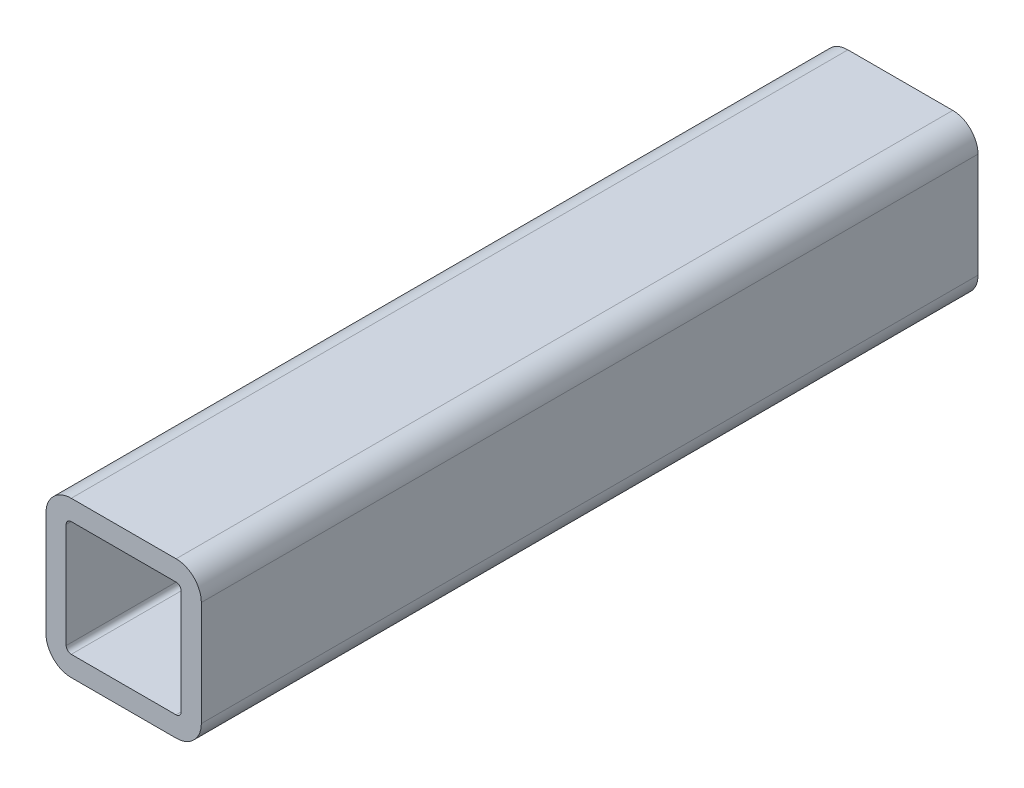
ISO-10303-21;
HEADER;
FILE_DESCRIPTION(('STEP AP214'),'2;1');
FILE_NAME('part.step','',(''),(''),'','','');
FILE_SCHEMA(('AUTOMOTIVE_DESIGN { 1 0 10303 214 1 1 1 1 }'));
ENDSEC;
DATA;
#1=APPLICATION_CONTEXT('core data for automotive mechanical design processes');
#2=APPLICATION_PROTOCOL_DEFINITION('international standard','automotive_design',2000,#1);
#3=PRODUCT_CONTEXT('',#1,'mechanical');
#4=PRODUCT('Part','Part','',(#3));
#5=PRODUCT_RELATED_PRODUCT_CATEGORY('part','',(#4));
#6=PRODUCT_DEFINITION_FORMATION('','',#4);
#7=PRODUCT_DEFINITION_CONTEXT('part definition',#1,'design');
#8=PRODUCT_DEFINITION('design','',#6,#7);
#9=PRODUCT_DEFINITION_SHAPE('','',#8);
#10=(LENGTH_UNIT() NAMED_UNIT(*) SI_UNIT(.MILLI.,.METRE.));
#11=(NAMED_UNIT(*) PLANE_ANGLE_UNIT() SI_UNIT($,.RADIAN.));
#12=(NAMED_UNIT(*) SI_UNIT($,.STERADIAN.) SOLID_ANGLE_UNIT());
#13=UNCERTAINTY_MEASURE_WITH_UNIT(LENGTH_MEASURE(1.E-05),#10,'distance_accuracy_value','');
#14=(GEOMETRIC_REPRESENTATION_CONTEXT(3) GLOBAL_UNCERTAINTY_ASSIGNED_CONTEXT((#13)) GLOBAL_UNIT_ASSIGNED_CONTEXT((#10,
#11,#12)) REPRESENTATION_CONTEXT('',''));
#15=CARTESIAN_POINT('',(0.,0.,0.));
#16=DIRECTION('',(0.,0.,1.));
#17=DIRECTION('',(1.,0.,0.));
#18=AXIS2_PLACEMENT_3D('',#15,#16,#17);
#19=CARTESIAN_POINT('',(4.28625000000001,-4.28625000000001,31.75));
#20=DIRECTION('',(0.,0.,1.));
#21=DIRECTION('',(1.,0.,0.));
#22=AXIS2_PLACEMENT_3D('',#19,#20,#21);
#23=PLANE('',#22);
#24=CARTESIAN_POINT('',(4.28625000000001,-4.28625000000001,31.75));
#25=DIRECTION('',(0.,0.,1.));
#26=DIRECTION('',(1.,0.,0.));
#27=AXIS2_PLACEMENT_3D('',#24,#25,#26);
#28=CIRCLE('',#27,2.06375);
#29=CARTESIAN_POINT('',(4.28625000000001,-6.35000000000001,31.75));
#30=VERTEX_POINT('',#29);
#31=CARTESIAN_POINT('',(6.35000000000001,-4.28625000000001,31.75));
#32=VERTEX_POINT('',#31);
#33=EDGE_CURVE('E248',#30,#32,#28,.T.);
#34=ORIENTED_EDGE('',*,*,#33,.T.);
#35=DIRECTION('',(0.,1.,0.));
#36=VECTOR('',#35,1.);
#37=CARTESIAN_POINT('',(6.35000000000001,-4.28625000000001,31.75));
#38=LINE('',#37,#36);
#39=CARTESIAN_POINT('',(6.35000000000001,4.28625000000001,31.75));
#40=VERTEX_POINT('',#39);
#41=EDGE_CURVE('E252',#32,#40,#38,.T.);
#42=ORIENTED_EDGE('',*,*,#41,.T.);
#43=CARTESIAN_POINT('',(4.28625000000001,4.28625000000001,31.75));
#44=DIRECTION('',(0.,0.,1.));
#45=DIRECTION('',(1.,0.,0.));
#46=AXIS2_PLACEMENT_3D('',#43,#44,#45);
#47=CIRCLE('',#46,2.06375);
#48=CARTESIAN_POINT('',(4.28625000000001,6.35000000000001,31.75));
#49=VERTEX_POINT('',#48);
#50=EDGE_CURVE('E256',#40,#49,#47,.T.);
#51=ORIENTED_EDGE('',*,*,#50,.T.);
#52=DIRECTION('',(-1.,0.,0.));
#53=VECTOR('',#52,1.);
#54=CARTESIAN_POINT('',(4.28625000000001,6.35000000000001,31.75));
#55=LINE('',#54,#53);
#56=CARTESIAN_POINT('',(-4.28625000000001,6.35000000000001,31.75));
#57=VERTEX_POINT('',#56);
#58=EDGE_CURVE('E259',#49,#57,#55,.T.);
#59=ORIENTED_EDGE('',*,*,#58,.T.);
#60=CARTESIAN_POINT('',(-4.28625000000001,4.28625000000001,31.75));
#61=DIRECTION('',(0.,0.,1.));
#62=DIRECTION('',(1.,0.,0.));
#63=AXIS2_PLACEMENT_3D('',#60,#61,#62);
#64=CIRCLE('',#63,2.06375);
#65=CARTESIAN_POINT('',(-6.35000000000001,4.28625000000001,31.75));
#66=VERTEX_POINT('',#65);
#67=EDGE_CURVE('E262',#57,#66,#64,.T.);
#68=ORIENTED_EDGE('',*,*,#67,.T.);
#69=DIRECTION('',(0.,-1.,0.));
#70=VECTOR('',#69,1.);
#71=CARTESIAN_POINT('',(-6.35000000000001,-4.28625000000001,31.75));
#72=LINE('',#71,#70);
#73=CARTESIAN_POINT('',(-6.35000000000001,-4.28625000000001,31.75));
#74=VERTEX_POINT('',#73);
#75=EDGE_CURVE('E265',#66,#74,#72,.T.);
#76=ORIENTED_EDGE('',*,*,#75,.T.);
#77=CARTESIAN_POINT('',(-4.28625000000001,-4.28625000000001,31.75));
#78=DIRECTION('',(0.,0.,1.));
#79=DIRECTION('',(1.,0.,0.));
#80=AXIS2_PLACEMENT_3D('',#77,#78,#79);
#81=CIRCLE('',#80,2.06375);
#82=CARTESIAN_POINT('',(-4.28625000000001,-6.35000000000001,31.75));
#83=VERTEX_POINT('',#82);
#84=EDGE_CURVE('E268',#74,#83,#81,.T.);
#85=ORIENTED_EDGE('',*,*,#84,.T.);
#86=DIRECTION('',(1.,0.,0.));
#87=VECTOR('',#86,1.);
#88=CARTESIAN_POINT('',(4.28625000000001,-6.35000000000001,31.75));
#89=LINE('',#88,#87);
#90=EDGE_CURVE('E271',#83,#30,#89,.T.);
#91=ORIENTED_EDGE('',*,*,#90,.T.);
#92=EDGE_LOOP('',(#34,#42,#51,#59,#68,#76,#85,#91));
#93=FACE_BOUND('',#92,.T.);
#94=DIRECTION('',(-1.,0.,0.));
#95=VECTOR('',#94,1.);
#96=CARTESIAN_POINT('',(4.28625000000001,4.69900000000001,31.75));
#97=LINE('',#96,#95);
#98=CARTESIAN_POINT('',(4.28625000000001,4.69900000000001,31.75));
#99=VERTEX_POINT('',#98);
#100=CARTESIAN_POINT('',(-4.28625000000001,4.69900000000001,31.75));
#101=VERTEX_POINT('',#100);
#102=EDGE_CURVE('E168',#99,#101,#97,.T.);
#103=ORIENTED_EDGE('',*,*,#102,.F.);
#104=CARTESIAN_POINT('',(4.28625000000001,4.28625000000001,31.75));
#105=DIRECTION('',(0.,0.,1.));
#106=DIRECTION('',(1.,0.,0.));
#107=AXIS2_PLACEMENT_3D('',#104,#105,#106);
#108=CIRCLE('',#107,0.412750000000003);
#109=CARTESIAN_POINT('',(4.69900000000001,4.28625000000001,31.75));
#110=VERTEX_POINT('',#109);
#111=EDGE_CURVE('E159',#110,#99,#108,.T.);
#112=ORIENTED_EDGE('',*,*,#111,.F.);
#113=DIRECTION('',(0.,1.,0.));
#114=VECTOR('',#113,1.);
#115=CARTESIAN_POINT('',(4.69900000000001,4.28625000000001,31.75));
#116=LINE('',#115,#114);
#117=CARTESIAN_POINT('',(4.69900000000001,-4.28625000000001,31.75));
#118=VERTEX_POINT('',#117);
#119=EDGE_CURVE('E200',#118,#110,#116,.T.);
#120=ORIENTED_EDGE('',*,*,#119,.F.);
#121=CARTESIAN_POINT('',(4.28625000000001,-4.28625000000001,31.75));
#122=DIRECTION('',(0.,0.,1.));
#123=DIRECTION('',(1.,0.,0.));
#124=AXIS2_PLACEMENT_3D('',#121,#122,#123);
#125=CIRCLE('',#124,0.412750000000003);
#126=CARTESIAN_POINT('',(4.28625000000001,-4.69900000000001,31.75));
#127=VERTEX_POINT('',#126);
#128=EDGE_CURVE('E197',#127,#118,#125,.T.);
#129=ORIENTED_EDGE('',*,*,#128,.F.);
#130=DIRECTION('',(1.,0.,0.));
#131=VECTOR('',#130,1.);
#132=CARTESIAN_POINT('',(4.28625000000001,-4.69900000000001,31.75));
#133=LINE('',#132,#131);
#134=CARTESIAN_POINT('',(-4.28625000000001,-4.69900000000001,31.75));
#135=VERTEX_POINT('',#134);
#136=EDGE_CURVE('E194',#135,#127,#133,.T.);
#137=ORIENTED_EDGE('',*,*,#136,.F.);
#138=CARTESIAN_POINT('',(-4.28625000000001,-4.28625000000001,31.75));
#139=DIRECTION('',(0.,0.,1.));
#140=DIRECTION('',(1.,0.,0.));
#141=AXIS2_PLACEMENT_3D('',#138,#139,#140);
#142=CIRCLE('',#141,0.412750000000003);
#143=CARTESIAN_POINT('',(-4.69900000000001,-4.28625000000001,31.75));
#144=VERTEX_POINT('',#143);
#145=EDGE_CURVE('E191',#144,#135,#142,.T.);
#146=ORIENTED_EDGE('',*,*,#145,.F.);
#147=DIRECTION('',(0.,-1.,0.));
#148=VECTOR('',#147,1.);
#149=CARTESIAN_POINT('',(-4.69900000000001,4.28625000000001,31.75));
#150=LINE('',#149,#148);
#151=CARTESIAN_POINT('',(-4.69900000000001,4.28625000000001,31.75));
#152=VERTEX_POINT('',#151);
#153=EDGE_CURVE('E186',#152,#144,#150,.T.);
#154=ORIENTED_EDGE('',*,*,#153,.F.);
#155=CARTESIAN_POINT('',(-4.28625000000001,4.28625000000001,31.75));
#156=DIRECTION('',(0.,0.,1.));
#157=DIRECTION('',(1.,0.,0.));
#158=AXIS2_PLACEMENT_3D('',#155,#156,#157);
#159=CIRCLE('',#158,0.412750000000003);
#160=EDGE_CURVE('E182',#101,#152,#159,.T.);
#161=ORIENTED_EDGE('',*,*,#160,.F.);
#162=EDGE_LOOP('',(#103,#112,#120,#129,#137,#146,#154,#161));
#163=FACE_BOUND('',#162,.T.);
#164=ADVANCED_FACE('F45',(#93,#163),#23,.T.);
#165=CARTESIAN_POINT('',(4.28625000000001,-4.28625000000001,-31.75));
#166=DIRECTION('',(0.,0.,1.));
#167=DIRECTION('',(1.,0.,0.));
#168=AXIS2_PLACEMENT_3D('',#165,#166,#167);
#169=PLANE('',#168);
#170=CARTESIAN_POINT('',(4.28625000000001,-4.28625000000001,-31.75));
#171=DIRECTION('',(0.,0.,1.));
#172=DIRECTION('',(1.,0.,0.));
#173=AXIS2_PLACEMENT_3D('',#170,#171,#172);
#174=CIRCLE('',#173,2.06375);
#175=CARTESIAN_POINT('',(4.28625000000001,-6.35000000000001,-31.75));
#176=VERTEX_POINT('',#175);
#177=CARTESIAN_POINT('',(6.35000000000001,-4.28625000000001,-31.75));
#178=VERTEX_POINT('',#177);
#179=EDGE_CURVE('E177',#176,#178,#174,.T.);
#180=ORIENTED_EDGE('',*,*,#179,.F.);
#181=DIRECTION('',(1.,0.,0.));
#182=VECTOR('',#181,1.);
#183=CARTESIAN_POINT('',(4.28625000000001,-6.35000000000001,-31.75));
#184=LINE('',#183,#182);
#185=CARTESIAN_POINT('',(-4.28625000000001,-6.35000000000001,-31.75));
#186=VERTEX_POINT('',#185);
#187=EDGE_CURVE('E253',#186,#176,#184,.T.);
#188=ORIENTED_EDGE('',*,*,#187,.F.);
#189=CARTESIAN_POINT('',(-4.28625000000001,-4.28625000000001,-31.75));
#190=DIRECTION('',(0.,0.,1.));
#191=DIRECTION('',(1.,0.,0.));
#192=AXIS2_PLACEMENT_3D('',#189,#190,#191);
#193=CIRCLE('',#192,2.06375);
#194=CARTESIAN_POINT('',(-6.35000000000001,-4.28625000000001,-31.75));
#195=VERTEX_POINT('',#194);
#196=EDGE_CURVE('E293',#195,#186,#193,.T.);
#197=ORIENTED_EDGE('',*,*,#196,.F.);
#198=DIRECTION('',(0.,-1.,0.));
#199=VECTOR('',#198,1.);
#200=CARTESIAN_POINT('',(-6.35000000000001,-4.28625000000001,-31.75));
#201=LINE('',#200,#199);
#202=CARTESIAN_POINT('',(-6.35000000000001,4.28625000000001,-31.75));
#203=VERTEX_POINT('',#202);
#204=EDGE_CURVE('E290',#203,#195,#201,.T.);
#205=ORIENTED_EDGE('',*,*,#204,.F.);
#206=CARTESIAN_POINT('',(-4.28625000000001,4.28625000000001,-31.75));
#207=DIRECTION('',(0.,0.,1.));
#208=DIRECTION('',(1.,0.,0.));
#209=AXIS2_PLACEMENT_3D('',#206,#207,#208);
#210=CIRCLE('',#209,2.06375);
#211=CARTESIAN_POINT('',(-4.28625000000001,6.35000000000001,-31.75));
#212=VERTEX_POINT('',#211);
#213=EDGE_CURVE('E287',#212,#203,#210,.T.);
#214=ORIENTED_EDGE('',*,*,#213,.F.);
#215=DIRECTION('',(-1.,0.,0.));
#216=VECTOR('',#215,1.);
#217=CARTESIAN_POINT('',(4.28625000000001,6.35000000000001,-31.75));
#218=LINE('',#217,#216);
#219=CARTESIAN_POINT('',(4.28625000000001,6.35000000000001,-31.75));
#220=VERTEX_POINT('',#219);
#221=EDGE_CURVE('E284',#220,#212,#218,.T.);
#222=ORIENTED_EDGE('',*,*,#221,.F.);
#223=CARTESIAN_POINT('',(4.28625000000001,4.28625000000001,-31.75));
#224=DIRECTION('',(0.,0.,1.));
#225=DIRECTION('',(1.,0.,0.));
#226=AXIS2_PLACEMENT_3D('',#223,#224,#225);
#227=CIRCLE('',#226,2.06375);
#228=CARTESIAN_POINT('',(6.35000000000001,4.28625000000001,-31.75));
#229=VERTEX_POINT('',#228);
#230=EDGE_CURVE('E281',#229,#220,#227,.T.);
#231=ORIENTED_EDGE('',*,*,#230,.F.);
#232=DIRECTION('',(0.,1.,0.));
#233=VECTOR('',#232,1.);
#234=CARTESIAN_POINT('',(6.35000000000001,-4.28625000000001,-31.75));
#235=LINE('',#234,#233);
#236=EDGE_CURVE('E278',#178,#229,#235,.T.);
#237=ORIENTED_EDGE('',*,*,#236,.F.);
#238=EDGE_LOOP('',(#180,#188,#197,#205,#214,#222,#231,#237));
#239=FACE_BOUND('',#238,.T.);
#240=CARTESIAN_POINT('',(4.28625000000001,4.28625000000001,-31.75));
#241=DIRECTION('',(0.,0.,1.));
#242=DIRECTION('',(1.,0.,0.));
#243=AXIS2_PLACEMENT_3D('',#240,#241,#242);
#244=CIRCLE('',#243,0.412750000000003);
#245=CARTESIAN_POINT('',(4.69900000000001,4.28625000000001,-31.75));
#246=VERTEX_POINT('',#245);
#247=CARTESIAN_POINT('',(4.28625000000001,4.69900000000001,-31.75));
#248=VERTEX_POINT('',#247);
#249=EDGE_CURVE('E69',#246,#248,#244,.T.);
#250=ORIENTED_EDGE('',*,*,#249,.T.);
#251=DIRECTION('',(-1.,0.,0.));
#252=VECTOR('',#251,1.);
#253=CARTESIAN_POINT('',(4.28625000000001,4.69900000000001,-31.75));
#254=LINE('',#253,#252);
#255=CARTESIAN_POINT('',(-4.28625000000001,4.69900000000001,-31.75));
#256=VERTEX_POINT('',#255);
#257=EDGE_CURVE('E175',#248,#256,#254,.T.);
#258=ORIENTED_EDGE('',*,*,#257,.T.);
#259=CARTESIAN_POINT('',(-4.28625000000001,4.28625000000001,-31.75));
#260=DIRECTION('',(0.,0.,1.));
#261=DIRECTION('',(1.,0.,0.));
#262=AXIS2_PLACEMENT_3D('',#259,#260,#261);
#263=CIRCLE('',#262,0.412750000000003);
#264=CARTESIAN_POINT('',(-4.69900000000001,4.28625000000001,-31.75));
#265=VERTEX_POINT('',#264);
#266=EDGE_CURVE('E207',#256,#265,#263,.T.);
#267=ORIENTED_EDGE('',*,*,#266,.T.);
#268=DIRECTION('',(0.,-1.,0.));
#269=VECTOR('',#268,1.);
#270=CARTESIAN_POINT('',(-4.69900000000001,4.28625000000001,-31.75));
#271=LINE('',#270,#269);
#272=CARTESIAN_POINT('',(-4.69900000000001,-4.28625000000001,-31.75));
#273=VERTEX_POINT('',#272);
#274=EDGE_CURVE('E211',#265,#273,#271,.T.);
#275=ORIENTED_EDGE('',*,*,#274,.T.);
#276=CARTESIAN_POINT('',(-4.28625000000001,-4.28625000000001,-31.75));
#277=DIRECTION('',(0.,0.,1.));
#278=DIRECTION('',(1.,0.,0.));
#279=AXIS2_PLACEMENT_3D('',#276,#277,#278);
#280=CIRCLE('',#279,0.412750000000003);
#281=CARTESIAN_POINT('',(-4.28625000000001,-4.69900000000001,-31.75));
#282=VERTEX_POINT('',#281);
#283=EDGE_CURVE('E215',#273,#282,#280,.T.);
#284=ORIENTED_EDGE('',*,*,#283,.T.);
#285=DIRECTION('',(1.,0.,0.));
#286=VECTOR('',#285,1.);
#287=CARTESIAN_POINT('',(4.28625000000001,-4.69900000000001,-31.75));
#288=LINE('',#287,#286);
#289=CARTESIAN_POINT('',(4.28625000000001,-4.69900000000001,-31.75));
#290=VERTEX_POINT('',#289);
#291=EDGE_CURVE('E219',#282,#290,#288,.T.);
#292=ORIENTED_EDGE('',*,*,#291,.T.);
#293=CARTESIAN_POINT('',(4.28625000000001,-4.28625000000001,-31.75));
#294=DIRECTION('',(0.,0.,1.));
#295=DIRECTION('',(1.,0.,0.));
#296=AXIS2_PLACEMENT_3D('',#293,#294,#295);
#297=CIRCLE('',#296,0.412750000000003);
#298=CARTESIAN_POINT('',(4.69900000000001,-4.28625000000001,-31.75));
#299=VERTEX_POINT('',#298);
#300=EDGE_CURVE('E223',#290,#299,#297,.T.);
#301=ORIENTED_EDGE('',*,*,#300,.T.);
#302=DIRECTION('',(0.,1.,0.));
#303=VECTOR('',#302,1.);
#304=CARTESIAN_POINT('',(4.69900000000001,4.28625000000001,-31.75));
#305=LINE('',#304,#303);
#306=EDGE_CURVE('E169',#299,#246,#305,.T.);
#307=ORIENTED_EDGE('',*,*,#306,.T.);
#308=EDGE_LOOP('',(#250,#258,#267,#275,#284,#292,#301,#307));
#309=FACE_BOUND('',#308,.T.);
#310=ADVANCED_FACE('F332',(#239,#309),#169,.F.);
#311=CARTESIAN_POINT('',(4.28625000000001,-4.28625000000001,31.75));
#312=DIRECTION('',(0.,0.,-1.));
#313=DIRECTION('',(-1.,0.,0.));
#314=AXIS2_PLACEMENT_3D('',#311,#312,#313);
#315=CYLINDRICAL_SURFACE('',#314,2.06375);
#316=ORIENTED_EDGE('',*,*,#179,.T.);
#317=DIRECTION('',(0.,0.,-1.));
#318=VECTOR('',#317,1.);
#319=CARTESIAN_POINT('',(6.35000000000001,-4.28625000000001,31.75));
#320=LINE('',#319,#318);
#321=EDGE_CURVE('E11',#32,#178,#320,.T.);
#322=ORIENTED_EDGE('',*,*,#321,.F.);
#323=ORIENTED_EDGE('',*,*,#33,.F.);
#324=DIRECTION('',(0.,0.,-1.));
#325=VECTOR('',#324,1.);
#326=CARTESIAN_POINT('',(4.28625000000001,-6.35000000000001,31.75));
#327=LINE('',#326,#325);
#328=EDGE_CURVE('E274',#30,#176,#327,.T.);
#329=ORIENTED_EDGE('',*,*,#328,.T.);
#330=EDGE_LOOP('',(#316,#322,#323,#329));
#331=FACE_BOUND('',#330,.T.);
#332=ADVANCED_FACE('F47',(#331),#315,.T.);
#333=CARTESIAN_POINT('',(6.35000000000001,-4.28625000000001,31.75));
#334=DIRECTION('',(-1.,0.,0.));
#335=DIRECTION('',(0.,0.,1.));
#336=AXIS2_PLACEMENT_3D('',#333,#334,#335);
#337=PLANE('',#336);
#338=ORIENTED_EDGE('',*,*,#236,.T.);
#339=DIRECTION('',(0.,0.,-1.));
#340=VECTOR('',#339,1.);
#341=CARTESIAN_POINT('',(6.35000000000001,4.28625000000001,31.75));
#342=LINE('',#341,#340);
#343=EDGE_CURVE('E54',#40,#229,#342,.T.);
#344=ORIENTED_EDGE('',*,*,#343,.F.);
#345=ORIENTED_EDGE('',*,*,#41,.F.);
#346=ORIENTED_EDGE('',*,*,#321,.T.);
#347=EDGE_LOOP('',(#338,#344,#345,#346));
#348=FACE_BOUND('',#347,.T.);
#349=ADVANCED_FACE('F349',(#348),#337,.F.);
#350=CARTESIAN_POINT('',(4.28625000000001,4.28625000000001,31.75));
#351=DIRECTION('',(0.,0.,-1.));
#352=DIRECTION('',(-1.,0.,0.));
#353=AXIS2_PLACEMENT_3D('',#350,#351,#352);
#354=CYLINDRICAL_SURFACE('',#353,2.06375);
#355=ORIENTED_EDGE('',*,*,#230,.T.);
#356=DIRECTION('',(0.,0.,-1.));
#357=VECTOR('',#356,1.);
#358=CARTESIAN_POINT('',(4.28625000000001,6.35000000000001,31.75));
#359=LINE('',#358,#357);
#360=EDGE_CURVE('E317',#49,#220,#359,.T.);
#361=ORIENTED_EDGE('',*,*,#360,.F.);
#362=ORIENTED_EDGE('',*,*,#50,.F.);
#363=ORIENTED_EDGE('',*,*,#343,.T.);
#364=EDGE_LOOP('',(#355,#361,#362,#363));
#365=FACE_BOUND('',#364,.T.);
#366=ADVANCED_FACE('F326',(#365),#354,.T.);
#367=CARTESIAN_POINT('',(4.28625000000001,6.35000000000001,31.75));
#368=DIRECTION('',(0.,-1.,0.));
#369=DIRECTION('',(0.,0.,-1.));
#370=AXIS2_PLACEMENT_3D('',#367,#368,#369);
#371=PLANE('',#370);
#372=ORIENTED_EDGE('',*,*,#221,.T.);
#373=DIRECTION('',(0.,0.,-1.));
#374=VECTOR('',#373,1.);
#375=CARTESIAN_POINT('',(-4.28625000000001,6.35000000000001,31.75));
#376=LINE('',#375,#374);
#377=EDGE_CURVE('E313',#57,#212,#376,.T.);
#378=ORIENTED_EDGE('',*,*,#377,.F.);
#379=ORIENTED_EDGE('',*,*,#58,.F.);
#380=ORIENTED_EDGE('',*,*,#360,.T.);
#381=EDGE_LOOP('',(#372,#378,#379,#380));
#382=FACE_BOUND('',#381,.T.);
#383=ADVANCED_FACE('F338',(#382),#371,.F.);
#384=CARTESIAN_POINT('',(-4.28625000000001,4.28625000000001,31.75));
#385=DIRECTION('',(0.,0.,-1.));
#386=DIRECTION('',(-1.,0.,0.));
#387=AXIS2_PLACEMENT_3D('',#384,#385,#386);
#388=CYLINDRICAL_SURFACE('',#387,2.06375);
#389=ORIENTED_EDGE('',*,*,#213,.T.);
#390=DIRECTION('',(0.,0.,-1.));
#391=VECTOR('',#390,1.);
#392=CARTESIAN_POINT('',(-6.35000000000001,4.28625000000001,31.75));
#393=LINE('',#392,#391);
#394=EDGE_CURVE('E309',#66,#203,#393,.T.);
#395=ORIENTED_EDGE('',*,*,#394,.F.);
#396=ORIENTED_EDGE('',*,*,#67,.F.);
#397=ORIENTED_EDGE('',*,*,#377,.T.);
#398=EDGE_LOOP('',(#389,#395,#396,#397));
#399=FACE_BOUND('',#398,.T.);
#400=ADVANCED_FACE('F342',(#399),#388,.T.);
#401=CARTESIAN_POINT('',(-6.35000000000001,-4.28625000000001,31.75));
#402=DIRECTION('',(1.,0.,0.));
#403=DIRECTION('',(0.,0.,-1.));
#404=AXIS2_PLACEMENT_3D('',#401,#402,#403);
#405=PLANE('',#404);
#406=ORIENTED_EDGE('',*,*,#204,.T.);
#407=DIRECTION('',(0.,0.,-1.));
#408=VECTOR('',#407,1.);
#409=CARTESIAN_POINT('',(-6.35000000000001,-4.28625000000001,31.75));
#410=LINE('',#409,#408);
#411=EDGE_CURVE('E305',#74,#195,#410,.T.);
#412=ORIENTED_EDGE('',*,*,#411,.F.);
#413=ORIENTED_EDGE('',*,*,#75,.F.);
#414=ORIENTED_EDGE('',*,*,#394,.T.);
#415=EDGE_LOOP('',(#406,#412,#413,#414));
#416=FACE_BOUND('',#415,.T.);
#417=ADVANCED_FACE('F362',(#416),#405,.F.);
#418=CARTESIAN_POINT('',(-4.28625000000001,-4.28625000000001,31.75));
#419=DIRECTION('',(0.,0.,-1.));
#420=DIRECTION('',(-1.,0.,0.));
#421=AXIS2_PLACEMENT_3D('',#418,#419,#420);
#422=CYLINDRICAL_SURFACE('',#421,2.06375);
#423=ORIENTED_EDGE('',*,*,#196,.T.);
#424=DIRECTION('',(0.,0.,-1.));
#425=VECTOR('',#424,1.);
#426=CARTESIAN_POINT('',(-4.28625000000001,-6.35000000000001,31.75));
#427=LINE('',#426,#425);
#428=EDGE_CURVE('E301',#83,#186,#427,.T.);
#429=ORIENTED_EDGE('',*,*,#428,.F.);
#430=ORIENTED_EDGE('',*,*,#84,.F.);
#431=ORIENTED_EDGE('',*,*,#411,.T.);
#432=EDGE_LOOP('',(#423,#429,#430,#431));
#433=FACE_BOUND('',#432,.T.);
#434=ADVANCED_FACE('F360',(#433),#422,.T.);
#435=CARTESIAN_POINT('',(4.28625000000001,-6.35000000000001,31.75));
#436=DIRECTION('',(0.,1.,0.));
#437=DIRECTION('',(0.,0.,1.));
#438=AXIS2_PLACEMENT_3D('',#435,#436,#437);
#439=PLANE('',#438);
#440=ORIENTED_EDGE('',*,*,#187,.T.);
#441=ORIENTED_EDGE('',*,*,#328,.F.);
#442=ORIENTED_EDGE('',*,*,#90,.F.);
#443=ORIENTED_EDGE('',*,*,#428,.T.);
#444=EDGE_LOOP('',(#440,#441,#442,#443));
#445=FACE_BOUND('',#444,.T.);
#446=ADVANCED_FACE('F355',(#445),#439,.F.);
#447=CARTESIAN_POINT('',(4.28625000000001,4.28625000000001,31.75));
#448=DIRECTION('',(0.,0.,-1.));
#449=DIRECTION('',(-1.,0.,0.));
#450=AXIS2_PLACEMENT_3D('',#447,#448,#449);
#451=CYLINDRICAL_SURFACE('',#450,0.412750000000003);
#452=ORIENTED_EDGE('',*,*,#249,.F.);
#453=DIRECTION('',(0.,0.,-1.));
#454=VECTOR('',#453,1.);
#455=CARTESIAN_POINT('',(4.69900000000001,4.28625000000001,31.75));
#456=LINE('',#455,#454);
#457=EDGE_CURVE('E163',#110,#246,#456,.T.);
#458=ORIENTED_EDGE('',*,*,#457,.F.);
#459=ORIENTED_EDGE('',*,*,#111,.T.);
#460=DIRECTION('',(0.,0.,-1.));
#461=VECTOR('',#460,1.);
#462=CARTESIAN_POINT('',(4.28625000000001,4.69900000000001,31.75));
#463=LINE('',#462,#461);
#464=EDGE_CURVE('E162',#99,#248,#463,.T.);
#465=ORIENTED_EDGE('',*,*,#464,.T.);
#466=EDGE_LOOP('',(#452,#458,#459,#465));
#467=FACE_BOUND('',#466,.T.);
#468=ADVANCED_FACE('F161',(#467),#451,.F.);
#469=CARTESIAN_POINT('',(4.28625000000001,4.69900000000001,31.75));
#470=DIRECTION('',(0.,-1.,0.));
#471=DIRECTION('',(0.,0.,-1.));
#472=AXIS2_PLACEMENT_3D('',#469,#470,#471);
#473=PLANE('',#472);
#474=ORIENTED_EDGE('',*,*,#257,.F.);
#475=ORIENTED_EDGE('',*,*,#464,.F.);
#476=ORIENTED_EDGE('',*,*,#102,.T.);
#477=DIRECTION('',(0.,0.,-1.));
#478=VECTOR('',#477,1.);
#479=CARTESIAN_POINT('',(-4.28625000000001,4.69900000000001,31.75));
#480=LINE('',#479,#478);
#481=EDGE_CURVE('E178',#101,#256,#480,.T.);
#482=ORIENTED_EDGE('',*,*,#481,.T.);
#483=EDGE_LOOP('',(#474,#475,#476,#482));
#484=FACE_BOUND('',#483,.T.);
#485=ADVANCED_FACE('F172',(#484),#473,.T.);
#486=CARTESIAN_POINT('',(-4.28625000000001,4.28625000000001,31.75));
#487=DIRECTION('',(0.,0.,-1.));
#488=DIRECTION('',(-1.,0.,0.));
#489=AXIS2_PLACEMENT_3D('',#486,#487,#488);
#490=CYLINDRICAL_SURFACE('',#489,0.412750000000003);
#491=ORIENTED_EDGE('',*,*,#266,.F.);
#492=ORIENTED_EDGE('',*,*,#481,.F.);
#493=ORIENTED_EDGE('',*,*,#160,.T.);
#494=DIRECTION('',(0.,0.,-1.));
#495=VECTOR('',#494,1.);
#496=CARTESIAN_POINT('',(-4.69900000000001,4.28625000000001,31.75));
#497=LINE('',#496,#495);
#498=EDGE_CURVE('E243',#152,#265,#497,.T.);
#499=ORIENTED_EDGE('',*,*,#498,.T.);
#500=EDGE_LOOP('',(#491,#492,#493,#499));
#501=FACE_BOUND('',#500,.T.);
#502=ADVANCED_FACE('F387',(#501),#490,.F.);
#503=CARTESIAN_POINT('',(-4.69900000000001,4.28625000000001,31.75));
#504=DIRECTION('',(1.,0.,0.));
#505=DIRECTION('',(0.,0.,-1.));
#506=AXIS2_PLACEMENT_3D('',#503,#504,#505);
#507=PLANE('',#506);
#508=ORIENTED_EDGE('',*,*,#274,.F.);
#509=ORIENTED_EDGE('',*,*,#498,.F.);
#510=ORIENTED_EDGE('',*,*,#153,.T.);
#511=DIRECTION('',(0.,0.,-1.));
#512=VECTOR('',#511,1.);
#513=CARTESIAN_POINT('',(-4.69900000000001,-4.28625000000001,31.75));
#514=LINE('',#513,#512);
#515=EDGE_CURVE('E240',#144,#273,#514,.T.);
#516=ORIENTED_EDGE('',*,*,#515,.T.);
#517=EDGE_LOOP('',(#508,#509,#510,#516));
#518=FACE_BOUND('',#517,.T.);
#519=ADVANCED_FACE('F391',(#518),#507,.T.);
#520=CARTESIAN_POINT('',(-4.28625000000001,-4.28625000000001,31.75));
#521=DIRECTION('',(0.,0.,-1.));
#522=DIRECTION('',(-1.,0.,0.));
#523=AXIS2_PLACEMENT_3D('',#520,#521,#522);
#524=CYLINDRICAL_SURFACE('',#523,0.412750000000003);
#525=ORIENTED_EDGE('',*,*,#283,.F.);
#526=ORIENTED_EDGE('',*,*,#515,.F.);
#527=ORIENTED_EDGE('',*,*,#145,.T.);
#528=DIRECTION('',(0.,0.,-1.));
#529=VECTOR('',#528,1.);
#530=CARTESIAN_POINT('',(-4.28625000000001,-4.69900000000001,31.75));
#531=LINE('',#530,#529);
#532=EDGE_CURVE('E237',#135,#282,#531,.T.);
#533=ORIENTED_EDGE('',*,*,#532,.T.);
#534=EDGE_LOOP('',(#525,#526,#527,#533));
#535=FACE_BOUND('',#534,.T.);
#536=ADVANCED_FACE('F397',(#535),#524,.F.);
#537=CARTESIAN_POINT('',(4.28625000000001,-4.69900000000001,31.75));
#538=DIRECTION('',(0.,1.,0.));
#539=DIRECTION('',(0.,0.,1.));
#540=AXIS2_PLACEMENT_3D('',#537,#538,#539);
#541=PLANE('',#540);
#542=ORIENTED_EDGE('',*,*,#291,.F.);
#543=ORIENTED_EDGE('',*,*,#532,.F.);
#544=ORIENTED_EDGE('',*,*,#136,.T.);
#545=DIRECTION('',(0.,0.,-1.));
#546=VECTOR('',#545,1.);
#547=CARTESIAN_POINT('',(4.28625000000001,-4.69900000000001,31.75));
#548=LINE('',#547,#546);
#549=EDGE_CURVE('E234',#127,#290,#548,.T.);
#550=ORIENTED_EDGE('',*,*,#549,.T.);
#551=EDGE_LOOP('',(#542,#543,#544,#550));
#552=FACE_BOUND('',#551,.T.);
#553=ADVANCED_FACE('F401',(#552),#541,.T.);
#554=CARTESIAN_POINT('',(4.28625000000001,-4.28625000000001,31.75));
#555=DIRECTION('',(0.,0.,-1.));
#556=DIRECTION('',(-1.,0.,0.));
#557=AXIS2_PLACEMENT_3D('',#554,#555,#556);
#558=CYLINDRICAL_SURFACE('',#557,0.412750000000003);
#559=ORIENTED_EDGE('',*,*,#300,.F.);
#560=ORIENTED_EDGE('',*,*,#549,.F.);
#561=ORIENTED_EDGE('',*,*,#128,.T.);
#562=DIRECTION('',(0.,0.,-1.));
#563=VECTOR('',#562,1.);
#564=CARTESIAN_POINT('',(4.69900000000001,-4.28625000000001,31.75));
#565=LINE('',#564,#563);
#566=EDGE_CURVE('E61',#118,#299,#565,.T.);
#567=ORIENTED_EDGE('',*,*,#566,.T.);
#568=EDGE_LOOP('',(#559,#560,#561,#567));
#569=FACE_BOUND('',#568,.T.);
#570=ADVANCED_FACE('F405',(#569),#558,.F.);
#571=CARTESIAN_POINT('',(4.69900000000001,4.28625000000001,31.75));
#572=DIRECTION('',(-1.,0.,0.));
#573=DIRECTION('',(0.,0.,1.));
#574=AXIS2_PLACEMENT_3D('',#571,#572,#573);
#575=PLANE('',#574);
#576=ORIENTED_EDGE('',*,*,#306,.F.);
#577=ORIENTED_EDGE('',*,*,#566,.F.);
#578=ORIENTED_EDGE('',*,*,#119,.T.);
#579=ORIENTED_EDGE('',*,*,#457,.T.);
#580=EDGE_LOOP('',(#576,#577,#578,#579));
#581=FACE_BOUND('',#580,.T.);
#582=ADVANCED_FACE('F409',(#581),#575,.T.);
#583=CLOSED_SHELL('',(#164,#310,#332,#349,#366,#383,#400,#417,#434,#446,#468,#485,#502,#519,
#536,#553,#570,#582));
#584=MANIFOLD_SOLID_BREP('B2',#583);
#585=ADVANCED_BREP_SHAPE_REPRESENTATION('',(#18,#584),#14);
#586=SHAPE_DEFINITION_REPRESENTATION(#9,#585);
ENDSEC;
END-ISO-10303-21;
